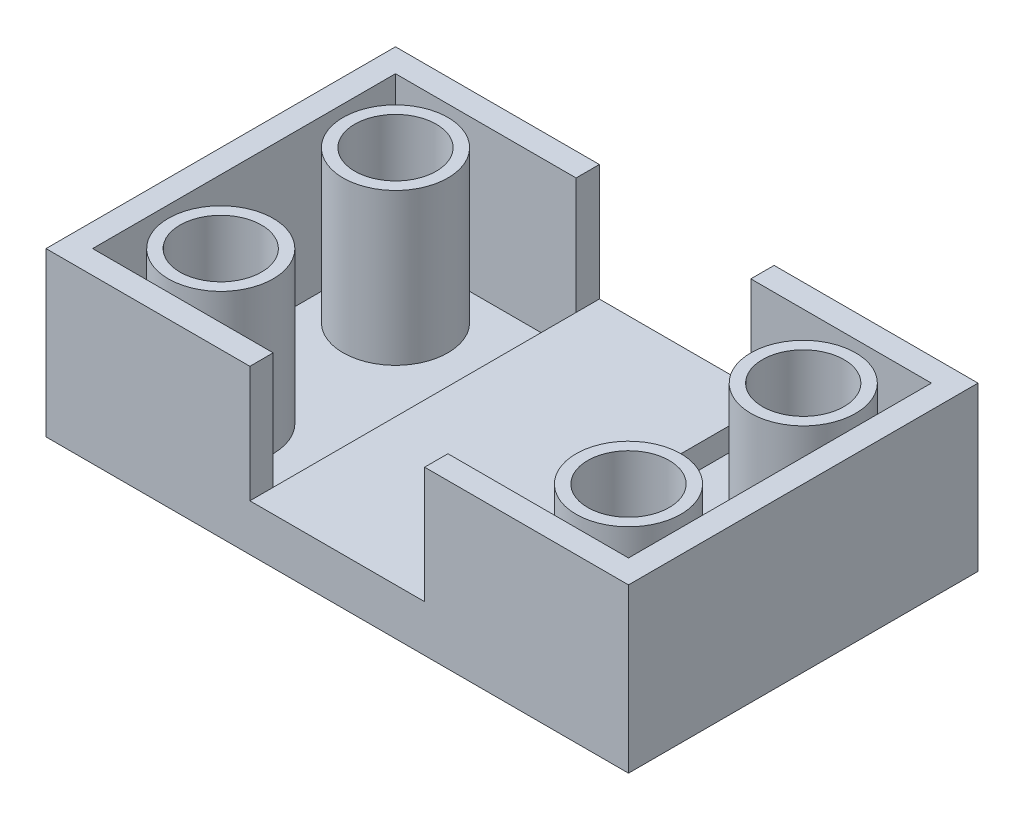
ISO-10303-21;
HEADER;
FILE_DESCRIPTION(('STEP AP214'),'2;1');
FILE_NAME('part.step','',(''),(''),'','','');
FILE_SCHEMA(('AUTOMOTIVE_DESIGN { 1 0 10303 214 1 1 1 1 }'));
ENDSEC;
DATA;
#1=APPLICATION_CONTEXT('core data for automotive mechanical design processes');
#2=APPLICATION_PROTOCOL_DEFINITION('international standard','automotive_design',2000,#1);
#3=PRODUCT_CONTEXT('',#1,'mechanical');
#4=PRODUCT('Part','Part','',(#3));
#5=PRODUCT_RELATED_PRODUCT_CATEGORY('part','',(#4));
#6=PRODUCT_DEFINITION_FORMATION('','',#4);
#7=PRODUCT_DEFINITION_CONTEXT('part definition',#1,'design');
#8=PRODUCT_DEFINITION('design','',#6,#7);
#9=PRODUCT_DEFINITION_SHAPE('','',#8);
#10=(LENGTH_UNIT() NAMED_UNIT(*) SI_UNIT(.MILLI.,.METRE.));
#11=(NAMED_UNIT(*) PLANE_ANGLE_UNIT() SI_UNIT($,.RADIAN.));
#12=(NAMED_UNIT(*) SI_UNIT($,.STERADIAN.) SOLID_ANGLE_UNIT());
#13=UNCERTAINTY_MEASURE_WITH_UNIT(LENGTH_MEASURE(1.E-05),#10,'distance_accuracy_value','');
#14=(GEOMETRIC_REPRESENTATION_CONTEXT(3) GLOBAL_UNCERTAINTY_ASSIGNED_CONTEXT((#13)) GLOBAL_UNIT_ASSIGNED_CONTEXT((#10,
#11,#12)) REPRESENTATION_CONTEXT('',''));
#15=CARTESIAN_POINT('',(0.,0.,0.));
#16=DIRECTION('',(0.,0.,1.));
#17=DIRECTION('',(1.,0.,0.));
#18=AXIS2_PLACEMENT_3D('',#15,#16,#17);
#19=CARTESIAN_POINT('',(17.5,15.,7.50000000000002));
#20=DIRECTION('',(0.,-1.,0.));
#21=DIRECTION('',(0.,0.,-1.));
#22=AXIS2_PLACEMENT_3D('',#19,#20,#21);
#23=CYLINDRICAL_SURFACE('',#22,2.5);
#24=CARTESIAN_POINT('',(17.5,0.750000000000001,7.50000000000002));
#25=DIRECTION('',(0.,1.,0.));
#26=DIRECTION('',(0.,0.,1.));
#27=AXIS2_PLACEMENT_3D('',#24,#25,#26);
#28=CIRCLE('',#27,2.5);
#29=CARTESIAN_POINT('',(17.5,0.750000000000001,10.));
#30=VERTEX_POINT('',#29);
#31=EDGE_CURVE('E399',#30,#30,#28,.F.);
#32=ORIENTED_EDGE('',*,*,#31,.T.);
#33=EDGE_LOOP('',(#32));
#34=FACE_BOUND('',#33,.T.);
#35=CARTESIAN_POINT('',(17.5,10.,7.50000000000002));
#36=DIRECTION('',(0.,1.,0.));
#37=DIRECTION('',(0.,0.,1.));
#38=AXIS2_PLACEMENT_3D('',#35,#36,#37);
#39=CIRCLE('',#38,2.5);
#40=CARTESIAN_POINT('',(17.5,10.,10.));
#41=VERTEX_POINT('',#40);
#42=EDGE_CURVE('E430',#41,#41,#39,.T.);
#43=ORIENTED_EDGE('',*,*,#42,.T.);
#44=EDGE_LOOP('',(#43));
#45=FACE_BOUND('',#44,.T.);
#46=ADVANCED_FACE('F39',(#34,#45),#23,.F.);
#47=CARTESIAN_POINT('',(17.5,15.,-7.49999999999994));
#48=DIRECTION('',(0.,-1.,0.));
#49=DIRECTION('',(0.,0.,-1.));
#50=AXIS2_PLACEMENT_3D('',#47,#48,#49);
#51=CYLINDRICAL_SURFACE('',#50,2.5);
#52=CARTESIAN_POINT('',(17.5,0.750000000000001,-7.49999999999994));
#53=DIRECTION('',(0.,1.,0.));
#54=DIRECTION('',(0.,0.,1.));
#55=AXIS2_PLACEMENT_3D('',#52,#53,#54);
#56=CIRCLE('',#55,2.5);
#57=CARTESIAN_POINT('',(17.5,0.750000000000001,-4.99999999999994));
#58=VERTEX_POINT('',#57);
#59=EDGE_CURVE('E403',#58,#58,#56,.F.);
#60=ORIENTED_EDGE('',*,*,#59,.T.);
#61=EDGE_LOOP('',(#60));
#62=FACE_BOUND('',#61,.T.);
#63=CARTESIAN_POINT('',(17.5,10.,-7.49999999999994));
#64=DIRECTION('',(0.,1.,0.));
#65=DIRECTION('',(0.,0.,1.));
#66=AXIS2_PLACEMENT_3D('',#63,#64,#65);
#67=CIRCLE('',#66,2.5);
#68=CARTESIAN_POINT('',(17.5,10.,-4.99999999999994));
#69=VERTEX_POINT('',#68);
#70=EDGE_CURVE('E424',#69,#69,#67,.T.);
#71=ORIENTED_EDGE('',*,*,#70,.T.);
#72=EDGE_LOOP('',(#71));
#73=FACE_BOUND('',#72,.T.);
#74=ADVANCED_FACE('F532',(#62,#73),#51,.F.);
#75=CARTESIAN_POINT('',(-17.5,15.,-7.4999999999999));
#76=DIRECTION('',(0.,-1.,0.));
#77=DIRECTION('',(0.,0.,-1.));
#78=AXIS2_PLACEMENT_3D('',#75,#76,#77);
#79=CYLINDRICAL_SURFACE('',#78,2.49999999999999);
#80=CARTESIAN_POINT('',(-17.5,0.750000000000001,-7.4999999999999));
#81=DIRECTION('',(0.,1.,0.));
#82=DIRECTION('',(0.,0.,1.));
#83=AXIS2_PLACEMENT_3D('',#80,#81,#82);
#84=CIRCLE('',#83,2.49999999999999);
#85=CARTESIAN_POINT('',(-17.5,0.750000000000001,-4.9999999999999));
#86=VERTEX_POINT('',#85);
#87=EDGE_CURVE('E411',#86,#86,#84,.F.);
#88=ORIENTED_EDGE('',*,*,#87,.T.);
#89=EDGE_LOOP('',(#88));
#90=FACE_BOUND('',#89,.T.);
#91=CARTESIAN_POINT('',(-17.5,10.,-7.4999999999999));
#92=DIRECTION('',(0.,1.,0.));
#93=DIRECTION('',(0.,0.,1.));
#94=AXIS2_PLACEMENT_3D('',#91,#92,#93);
#95=CIRCLE('',#94,2.49999999999999);
#96=CARTESIAN_POINT('',(-17.5,10.,-4.9999999999999));
#97=VERTEX_POINT('',#96);
#98=EDGE_CURVE('E419',#97,#97,#95,.T.);
#99=ORIENTED_EDGE('',*,*,#98,.T.);
#100=EDGE_LOOP('',(#99));
#101=FACE_BOUND('',#100,.T.);
#102=ADVANCED_FACE('F538',(#90,#101),#79,.F.);
#103=CARTESIAN_POINT('',(-17.5,15.,7.49999999999998));
#104=DIRECTION('',(0.,-1.,0.));
#105=DIRECTION('',(0.,0.,-1.));
#106=AXIS2_PLACEMENT_3D('',#103,#104,#105);
#107=CYLINDRICAL_SURFACE('',#106,2.49999999999999);
#108=CARTESIAN_POINT('',(-17.5,0.750000000000001,7.49999999999998));
#109=DIRECTION('',(0.,1.,0.));
#110=DIRECTION('',(0.,0.,1.));
#111=AXIS2_PLACEMENT_3D('',#108,#109,#110);
#112=CIRCLE('',#111,2.49999999999999);
#113=CARTESIAN_POINT('',(-17.5,0.750000000000001,9.99999999999997));
#114=VERTEX_POINT('',#113);
#115=EDGE_CURVE('E407',#114,#114,#112,.F.);
#116=ORIENTED_EDGE('',*,*,#115,.T.);
#117=EDGE_LOOP('',(#116));
#118=FACE_BOUND('',#117,.T.);
#119=CARTESIAN_POINT('',(-17.5,10.,7.49999999999998));
#120=DIRECTION('',(0.,1.,0.));
#121=DIRECTION('',(0.,0.,1.));
#122=AXIS2_PLACEMENT_3D('',#119,#120,#121);
#123=CIRCLE('',#122,2.49999999999999);
#124=CARTESIAN_POINT('',(-17.5,10.,9.99999999999997));
#125=VERTEX_POINT('',#124);
#126=EDGE_CURVE('E260',#125,#125,#123,.T.);
#127=ORIENTED_EDGE('',*,*,#126,.T.);
#128=EDGE_LOOP('',(#127));
#129=FACE_BOUND('',#128,.T.);
#130=ADVANCED_FACE('F509',(#118,#129),#107,.F.);
#131=CARTESIAN_POINT('',(0.,15.,0.));
#132=DIRECTION('',(0.,1.,0.));
#133=DIRECTION('',(0.,0.,1.));
#134=AXIS2_PLACEMENT_3D('',#131,#132,#133);
#135=PLANE('',#134);
#136=CARTESIAN_POINT('',(-17.5,15.,7.49999999999998));
#137=DIRECTION('',(0.,1.,0.));
#138=DIRECTION('',(0.,0.,1.));
#139=AXIS2_PLACEMENT_3D('',#136,#137,#138);
#140=CIRCLE('',#139,3.5);
#141=CARTESIAN_POINT('',(-17.5,15.,11.));
#142=VERTEX_POINT('',#141);
#143=EDGE_CURVE('E220',#142,#142,#140,.T.);
#144=ORIENTED_EDGE('',*,*,#143,.F.);
#145=EDGE_LOOP('',(#144));
#146=FACE_BOUND('',#145,.T.);
#147=CARTESIAN_POINT('',(-17.5,15.,7.49999999999998));
#148=DIRECTION('',(0.,1.,0.));
#149=DIRECTION('',(0.,0.,1.));
#150=AXIS2_PLACEMENT_3D('',#147,#148,#149);
#151=CIRCLE('',#150,4.5);
#152=CARTESIAN_POINT('',(-17.5,15.,12.));
#153=VERTEX_POINT('',#152);
#154=EDGE_CURVE('E264',#153,#153,#151,.T.);
#155=ORIENTED_EDGE('',*,*,#154,.T.);
#156=EDGE_LOOP('',(#155));
#157=FACE_BOUND('',#156,.T.);
#158=ADVANCED_FACE('F505',(#146,#157),#135,.T.);
#159=CARTESIAN_POINT('',(-17.5,15.,-7.4999999999999));
#160=DIRECTION('',(0.,1.,0.));
#161=DIRECTION('',(0.,0.,1.));
#162=AXIS2_PLACEMENT_3D('',#159,#160,#161);
#163=CIRCLE('',#162,3.5);
#164=CARTESIAN_POINT('',(-17.5,15.,-3.9999999999999));
#165=VERTEX_POINT('',#164);
#166=EDGE_CURVE('E428',#165,#165,#163,.T.);
#167=ORIENTED_EDGE('',*,*,#166,.F.);
#168=EDGE_LOOP('',(#167));
#169=FACE_BOUND('',#168,.T.);
#170=CARTESIAN_POINT('',(-17.5,15.,-7.4999999999999));
#171=DIRECTION('',(0.,1.,0.));
#172=DIRECTION('',(0.,0.,1.));
#173=AXIS2_PLACEMENT_3D('',#170,#171,#172);
#174=CIRCLE('',#173,4.5);
#175=CARTESIAN_POINT('',(-17.5,15.,-2.9999999999999));
#176=VERTEX_POINT('',#175);
#177=EDGE_CURVE('E211',#176,#176,#174,.T.);
#178=ORIENTED_EDGE('',*,*,#177,.T.);
#179=EDGE_LOOP('',(#178));
#180=FACE_BOUND('',#179,.T.);
#181=ADVANCED_FACE('F508',(#169,#180),#135,.T.);
#182=CARTESIAN_POINT('',(17.5,15.,7.50000000000002));
#183=DIRECTION('',(0.,1.,0.));
#184=DIRECTION('',(0.,0.,1.));
#185=AXIS2_PLACEMENT_3D('',#182,#183,#184);
#186=CIRCLE('',#185,3.5);
#187=CARTESIAN_POINT('',(17.5,15.,11.));
#188=VERTEX_POINT('',#187);
#189=EDGE_CURVE('E470',#188,#188,#186,.T.);
#190=ORIENTED_EDGE('',*,*,#189,.F.);
#191=EDGE_LOOP('',(#190));
#192=FACE_BOUND('',#191,.T.);
#193=CARTESIAN_POINT('',(17.5,15.,7.50000000000002));
#194=DIRECTION('',(0.,1.,0.));
#195=DIRECTION('',(0.,0.,1.));
#196=AXIS2_PLACEMENT_3D('',#193,#194,#195);
#197=CIRCLE('',#196,4.5);
#198=CARTESIAN_POINT('',(17.5,15.,12.));
#199=VERTEX_POINT('',#198);
#200=EDGE_CURVE('E284',#199,#199,#197,.T.);
#201=ORIENTED_EDGE('',*,*,#200,.T.);
#202=EDGE_LOOP('',(#201));
#203=FACE_BOUND('',#202,.T.);
#204=ADVANCED_FACE('F699',(#192,#203),#135,.T.);
#205=CARTESIAN_POINT('',(17.5,15.,-7.49999999999994));
#206=DIRECTION('',(0.,1.,0.));
#207=DIRECTION('',(0.,0.,1.));
#208=AXIS2_PLACEMENT_3D('',#205,#206,#207);
#209=CIRCLE('',#208,3.5);
#210=CARTESIAN_POINT('',(17.5,15.,-3.99999999999994));
#211=VERTEX_POINT('',#210);
#212=EDGE_CURVE('E434',#211,#211,#209,.T.);
#213=ORIENTED_EDGE('',*,*,#212,.F.);
#214=EDGE_LOOP('',(#213));
#215=FACE_BOUND('',#214,.T.);
#216=CARTESIAN_POINT('',(17.5,15.,-7.49999999999994));
#217=DIRECTION('',(0.,1.,0.));
#218=DIRECTION('',(0.,0.,1.));
#219=AXIS2_PLACEMENT_3D('',#216,#217,#218);
#220=CIRCLE('',#219,4.5);
#221=CARTESIAN_POINT('',(17.5,15.,-2.99999999999994));
#222=VERTEX_POINT('',#221);
#223=EDGE_CURVE('E217',#222,#222,#220,.T.);
#224=ORIENTED_EDGE('',*,*,#223,.T.);
#225=EDGE_LOOP('',(#224));
#226=FACE_BOUND('',#225,.T.);
#227=ADVANCED_FACE('F694',(#215,#226),#135,.T.);
#228=CARTESIAN_POINT('',(-7.5,5.,15.));
#229=DIRECTION('',(-1.,0.,0.));
#230=DIRECTION('',(0.,0.,1.));
#231=AXIS2_PLACEMENT_3D('',#228,#229,#230);
#232=PLANE('',#231);
#233=DIRECTION('',(0.,1.,0.));
#234=VECTOR('',#233,1.);
#235=CARTESIAN_POINT('',(-7.5,5.,-12.9999999999999));
#236=LINE('',#235,#234);
#237=CARTESIAN_POINT('',(-7.5,5.,-12.9999999999999));
#238=VERTEX_POINT('',#237);
#239=CARTESIAN_POINT('',(-7.5,15.,-12.9999999999999));
#240=VERTEX_POINT('',#239);
#241=EDGE_CURVE('E266',#238,#240,#236,.T.);
#242=ORIENTED_EDGE('',*,*,#241,.F.);
#243=DIRECTION('',(0.,0.,1.));
#244=VECTOR('',#243,1.);
#245=CARTESIAN_POINT('',(-7.5,5.,15.));
#246=LINE('',#245,#244);
#247=CARTESIAN_POINT('',(-7.5,5.,-15.));
#248=VERTEX_POINT('',#247);
#249=EDGE_CURVE('E310',#248,#238,#246,.T.);
#250=ORIENTED_EDGE('',*,*,#249,.F.);
#251=DIRECTION('',(0.,1.,0.));
#252=VECTOR('',#251,1.);
#253=CARTESIAN_POINT('',(-7.5,5.,-15.));
#254=LINE('',#253,#252);
#255=CARTESIAN_POINT('',(-7.5,15.,-15.));
#256=VERTEX_POINT('',#255);
#257=EDGE_CURVE('E340',#248,#256,#254,.T.);
#258=ORIENTED_EDGE('',*,*,#257,.T.);
#259=DIRECTION('',(0.,0.,1.));
#260=VECTOR('',#259,1.);
#261=CARTESIAN_POINT('',(-7.5,15.,15.));
#262=LINE('',#261,#260);
#263=EDGE_CURVE('E331',#256,#240,#262,.T.);
#264=ORIENTED_EDGE('',*,*,#263,.T.);
#265=EDGE_LOOP('',(#242,#250,#258,#264));
#266=FACE_BOUND('',#265,.T.);
#267=ADVANCED_FACE('F653',(#266),#232,.F.);
#268=CARTESIAN_POINT('',(7.5,5.,15.));
#269=DIRECTION('',(1.,0.,0.));
#270=DIRECTION('',(0.,0.,-1.));
#271=AXIS2_PLACEMENT_3D('',#268,#269,#270);
#272=PLANE('',#271);
#273=DIRECTION('',(0.,1.,0.));
#274=VECTOR('',#273,1.);
#275=CARTESIAN_POINT('',(7.5,5.,13.));
#276=LINE('',#275,#274);
#277=CARTESIAN_POINT('',(7.5,5.,13.));
#278=VERTEX_POINT('',#277);
#279=CARTESIAN_POINT('',(7.5,15.,13.));
#280=VERTEX_POINT('',#279);
#281=EDGE_CURVE('E283',#278,#280,#276,.T.);
#282=ORIENTED_EDGE('',*,*,#281,.F.);
#283=DIRECTION('',(0.,0.,-1.));
#284=VECTOR('',#283,1.);
#285=CARTESIAN_POINT('',(7.5,5.,15.));
#286=LINE('',#285,#284);
#287=CARTESIAN_POINT('',(7.5,5.,15.));
#288=VERTEX_POINT('',#287);
#289=EDGE_CURVE('E321',#288,#278,#286,.T.);
#290=ORIENTED_EDGE('',*,*,#289,.F.);
#291=DIRECTION('',(0.,1.,0.));
#292=VECTOR('',#291,1.);
#293=CARTESIAN_POINT('',(7.5,5.,15.));
#294=LINE('',#293,#292);
#295=CARTESIAN_POINT('',(7.5,15.,15.));
#296=VERTEX_POINT('',#295);
#297=EDGE_CURVE('E348',#288,#296,#294,.T.);
#298=ORIENTED_EDGE('',*,*,#297,.T.);
#299=DIRECTION('',(0.,0.,-1.));
#300=VECTOR('',#299,1.);
#301=CARTESIAN_POINT('',(7.5,15.,15.));
#302=LINE('',#301,#300);
#303=EDGE_CURVE('E336',#296,#280,#302,.T.);
#304=ORIENTED_EDGE('',*,*,#303,.T.);
#305=EDGE_LOOP('',(#282,#290,#298,#304));
#306=FACE_BOUND('',#305,.T.);
#307=ADVANCED_FACE('F669',(#306),#272,.F.);
#308=DIRECTION('',(-1.,0.,0.));
#309=VECTOR('',#308,1.);
#310=CARTESIAN_POINT('',(25.,15.,-13.));
#311=LINE('',#310,#309);
#312=CARTESIAN_POINT('',(-23.,15.,-12.9999999999999));
#313=VERTEX_POINT('',#312);
#314=EDGE_CURVE('E198',#240,#313,#311,.T.);
#315=ORIENTED_EDGE('',*,*,#314,.F.);
#316=ORIENTED_EDGE('',*,*,#263,.F.);
#317=DIRECTION('',(-1.,0.,0.));
#318=VECTOR('',#317,1.);
#319=CARTESIAN_POINT('',(25.,15.,-15.));
#320=LINE('',#319,#318);
#321=CARTESIAN_POINT('',(-25.,15.,-14.9999999999999));
#322=VERTEX_POINT('',#321);
#323=EDGE_CURVE('E365',#256,#322,#320,.T.);
#324=ORIENTED_EDGE('',*,*,#323,.T.);
#325=DIRECTION('',(0.,0.,1.));
#326=VECTOR('',#325,1.);
#327=CARTESIAN_POINT('',(-25.,15.,15.));
#328=LINE('',#327,#326);
#329=CARTESIAN_POINT('',(-25.,15.,15.));
#330=VERTEX_POINT('',#329);
#331=EDGE_CURVE('E343',#322,#330,#328,.T.);
#332=ORIENTED_EDGE('',*,*,#331,.T.);
#333=DIRECTION('',(1.,0.,0.));
#334=VECTOR('',#333,1.);
#335=CARTESIAN_POINT('',(25.,15.,15.));
#336=LINE('',#335,#334);
#337=CARTESIAN_POINT('',(-7.5,15.,15.));
#338=VERTEX_POINT('',#337);
#339=EDGE_CURVE('E358',#330,#338,#336,.T.);
#340=ORIENTED_EDGE('',*,*,#339,.T.);
#341=CARTESIAN_POINT('',(-7.5,15.,13.));
#342=VERTEX_POINT('',#341);
#343=EDGE_CURVE('E309',#342,#338,#262,.T.);
#344=ORIENTED_EDGE('',*,*,#343,.F.);
#345=DIRECTION('',(1.,0.,0.));
#346=VECTOR('',#345,1.);
#347=CARTESIAN_POINT('',(25.,15.,13.));
#348=LINE('',#347,#346);
#349=CARTESIAN_POINT('',(-23.,15.,13.));
#350=VERTEX_POINT('',#349);
#351=EDGE_CURVE('E248',#350,#342,#348,.T.);
#352=ORIENTED_EDGE('',*,*,#351,.F.);
#353=DIRECTION('',(0.,0.,1.));
#354=VECTOR('',#353,1.);
#355=CARTESIAN_POINT('',(-23.,15.,15.));
#356=LINE('',#355,#354);
#357=EDGE_CURVE('E192',#313,#350,#356,.T.);
#358=ORIENTED_EDGE('',*,*,#357,.F.);
#359=EDGE_LOOP('',(#315,#316,#324,#332,#340,#344,#352,#358));
#360=FACE_BOUND('',#359,.T.);
#361=ADVANCED_FACE('F550',(#360),#135,.T.);
#362=DIRECTION('',(1.,0.,0.));
#363=VECTOR('',#362,1.);
#364=CARTESIAN_POINT('',(25.,15.,13.));
#365=LINE('',#364,#363);
#366=CARTESIAN_POINT('',(23.,15.,13.));
#367=VERTEX_POINT('',#366);
#368=EDGE_CURVE('E247',#280,#367,#365,.T.);
#369=ORIENTED_EDGE('',*,*,#368,.F.);
#370=ORIENTED_EDGE('',*,*,#303,.F.);
#371=CARTESIAN_POINT('',(25.,15.,15.));
#372=VERTEX_POINT('',#371);
#373=EDGE_CURVE('E357',#296,#372,#336,.T.);
#374=ORIENTED_EDGE('',*,*,#373,.T.);
#375=DIRECTION('',(0.,0.,-1.));
#376=VECTOR('',#375,1.);
#377=CARTESIAN_POINT('',(25.,15.,15.));
#378=LINE('',#377,#376);
#379=CARTESIAN_POINT('',(25.,15.,-15.));
#380=VERTEX_POINT('',#379);
#381=EDGE_CURVE('E362',#372,#380,#378,.T.);
#382=ORIENTED_EDGE('',*,*,#381,.T.);
#383=CARTESIAN_POINT('',(7.5,15.,-15.));
#384=VERTEX_POINT('',#383);
#385=EDGE_CURVE('E366',#380,#384,#320,.T.);
#386=ORIENTED_EDGE('',*,*,#385,.T.);
#387=CARTESIAN_POINT('',(7.5,15.,-12.9999999999999));
#388=VERTEX_POINT('',#387);
#389=EDGE_CURVE('E335',#388,#384,#302,.T.);
#390=ORIENTED_EDGE('',*,*,#389,.F.);
#391=DIRECTION('',(-1.,0.,0.));
#392=VECTOR('',#391,1.);
#393=CARTESIAN_POINT('',(25.,15.,-13.));
#394=LINE('',#393,#392);
#395=CARTESIAN_POINT('',(23.,15.,-13.));
#396=VERTEX_POINT('',#395);
#397=EDGE_CURVE('E203',#396,#388,#394,.T.);
#398=ORIENTED_EDGE('',*,*,#397,.F.);
#399=DIRECTION('',(0.,0.,-1.));
#400=VECTOR('',#399,1.);
#401=CARTESIAN_POINT('',(23.,15.,15.));
#402=LINE('',#401,#400);
#403=EDGE_CURVE('E251',#367,#396,#402,.T.);
#404=ORIENTED_EDGE('',*,*,#403,.F.);
#405=EDGE_LOOP('',(#369,#370,#374,#382,#386,#390,#398,#404));
#406=FACE_BOUND('',#405,.T.);
#407=ADVANCED_FACE('F511',(#406),#135,.T.);
#408=CARTESIAN_POINT('',(0.,0.,0.));
#409=DIRECTION('',(0.,1.,0.));
#410=DIRECTION('',(0.,0.,1.));
#411=AXIS2_PLACEMENT_3D('',#408,#409,#410);
#412=PLANE('',#411);
#413=DIRECTION('',(1.,0.,0.));
#414=VECTOR('',#413,1.);
#415=CARTESIAN_POINT('',(0.,0.,-13.9999999999999));
#416=LINE('',#415,#414);
#417=CARTESIAN_POINT('',(-24.,0.,-13.9999999999999));
#418=VERTEX_POINT('',#417);
#419=CARTESIAN_POINT('',(24.,0.,-14.));
#420=VERTEX_POINT('',#419);
#421=EDGE_CURVE('E446',#418,#420,#416,.T.);
#422=ORIENTED_EDGE('',*,*,#421,.T.);
#423=DIRECTION('',(0.,0.,1.));
#424=VECTOR('',#423,1.);
#425=CARTESIAN_POINT('',(24.,0.,0.));
#426=LINE('',#425,#424);
#427=CARTESIAN_POINT('',(24.,0.,14.));
#428=VERTEX_POINT('',#427);
#429=EDGE_CURVE('E449',#420,#428,#426,.T.);
#430=ORIENTED_EDGE('',*,*,#429,.T.);
#431=DIRECTION('',(-1.,0.,0.));
#432=VECTOR('',#431,1.);
#433=CARTESIAN_POINT('',(0.,0.,14.));
#434=LINE('',#433,#432);
#435=CARTESIAN_POINT('',(-24.,0.,14.));
#436=VERTEX_POINT('',#435);
#437=EDGE_CURVE('E440',#428,#436,#434,.T.);
#438=ORIENTED_EDGE('',*,*,#437,.T.);
#439=DIRECTION('',(0.,0.,-1.));
#440=VECTOR('',#439,1.);
#441=CARTESIAN_POINT('',(-24.,0.,0.));
#442=LINE('',#441,#440);
#443=EDGE_CURVE('E443',#436,#418,#442,.T.);
#444=ORIENTED_EDGE('',*,*,#443,.T.);
#445=EDGE_LOOP('',(#422,#430,#438,#444));
#446=FACE_BOUND('',#445,.T.);
#447=CARTESIAN_POINT('',(17.5,0.,7.50000000000002));
#448=DIRECTION('',(0.,1.,0.));
#449=DIRECTION('',(0.,0.,1.));
#450=AXIS2_PLACEMENT_3D('',#447,#448,#449);
#451=CIRCLE('',#450,3.79903810567665);
#452=CARTESIAN_POINT('',(17.5,0.,11.2990381056767));
#453=VERTEX_POINT('',#452);
#454=EDGE_CURVE('E395',#453,#453,#451,.T.);
#455=ORIENTED_EDGE('',*,*,#454,.T.);
#456=EDGE_LOOP('',(#455));
#457=FACE_BOUND('',#456,.T.);
#458=CARTESIAN_POINT('',(17.5,0.,-7.49999999999994));
#459=DIRECTION('',(0.,1.,0.));
#460=DIRECTION('',(0.,0.,1.));
#461=AXIS2_PLACEMENT_3D('',#458,#459,#460);
#462=CIRCLE('',#461,3.79903810567665);
#463=CARTESIAN_POINT('',(17.5,0.,-3.70096189432328));
#464=VERTEX_POINT('',#463);
#465=EDGE_CURVE('E391',#464,#464,#462,.T.);
#466=ORIENTED_EDGE('',*,*,#465,.T.);
#467=EDGE_LOOP('',(#466));
#468=FACE_BOUND('',#467,.T.);
#469=CARTESIAN_POINT('',(-17.5,0.,7.49999999999998));
#470=DIRECTION('',(0.,1.,0.));
#471=DIRECTION('',(0.,0.,1.));
#472=AXIS2_PLACEMENT_3D('',#469,#470,#471);
#473=CIRCLE('',#472,3.79903810567665);
#474=CARTESIAN_POINT('',(-17.5,0.,11.2990381056766));
#475=VERTEX_POINT('',#474);
#476=EDGE_CURVE('E387',#475,#475,#473,.T.);
#477=ORIENTED_EDGE('',*,*,#476,.T.);
#478=EDGE_LOOP('',(#477));
#479=FACE_BOUND('',#478,.T.);
#480=CARTESIAN_POINT('',(-17.5,0.,-7.4999999999999));
#481=DIRECTION('',(0.,1.,0.));
#482=DIRECTION('',(0.,0.,1.));
#483=AXIS2_PLACEMENT_3D('',#480,#481,#482);
#484=CIRCLE('',#483,3.79903810567665);
#485=CARTESIAN_POINT('',(-17.5,0.,-3.70096189432325));
#486=VERTEX_POINT('',#485);
#487=EDGE_CURVE('E383',#486,#486,#484,.T.);
#488=ORIENTED_EDGE('',*,*,#487,.T.);
#489=EDGE_LOOP('',(#488));
#490=FACE_BOUND('',#489,.T.);
#491=ADVANCED_FACE('F549',(#446,#457,#468,#479,#490),#412,.F.);
#492=CARTESIAN_POINT('',(-25.,15.,15.));
#493=DIRECTION('',(1.,0.,0.));
#494=DIRECTION('',(0.,0.,-1.));
#495=AXIS2_PLACEMENT_3D('',#492,#493,#494);
#496=PLANE('',#495);
#497=DIRECTION('',(0.,-1.,0.));
#498=VECTOR('',#497,1.);
#499=CARTESIAN_POINT('',(-25.,15.,-14.9999999999999));
#500=LINE('',#499,#498);
#501=CARTESIAN_POINT('',(-25.,1.,-14.9999999999999));
#502=VERTEX_POINT('',#501);
#503=EDGE_CURVE('E370',#322,#502,#500,.T.);
#504=ORIENTED_EDGE('',*,*,#503,.T.);
#505=DIRECTION('',(0.,0.,1.));
#506=VECTOR('',#505,1.);
#507=CARTESIAN_POINT('',(-25.,1.,15.));
#508=LINE('',#507,#506);
#509=CARTESIAN_POINT('',(-25.,1.,15.));
#510=VERTEX_POINT('',#509);
#511=EDGE_CURVE('E49',#502,#510,#508,.T.);
#512=ORIENTED_EDGE('',*,*,#511,.T.);
#513=DIRECTION('',(0.,-1.,0.));
#514=VECTOR('',#513,1.);
#515=CARTESIAN_POINT('',(-25.,15.,15.));
#516=LINE('',#515,#514);
#517=EDGE_CURVE('E380',#330,#510,#516,.T.);
#518=ORIENTED_EDGE('',*,*,#517,.F.);
#519=ORIENTED_EDGE('',*,*,#331,.F.);
#520=EDGE_LOOP('',(#504,#512,#518,#519));
#521=FACE_BOUND('',#520,.T.);
#522=ADVANCED_FACE('F554',(#521),#496,.F.);
#523=CARTESIAN_POINT('',(25.,15.,15.));
#524=DIRECTION('',(0.,0.,-1.));
#525=DIRECTION('',(-1.,0.,0.));
#526=AXIS2_PLACEMENT_3D('',#523,#524,#525);
#527=PLANE('',#526);
#528=ORIENTED_EDGE('',*,*,#517,.T.);
#529=DIRECTION('',(1.,0.,0.));
#530=VECTOR('',#529,1.);
#531=CARTESIAN_POINT('',(25.,1.,15.));
#532=LINE('',#531,#530);
#533=CARTESIAN_POINT('',(25.,1.,15.));
#534=VERTEX_POINT('',#533);
#535=EDGE_CURVE('E11',#510,#534,#532,.T.);
#536=ORIENTED_EDGE('',*,*,#535,.T.);
#537=DIRECTION('',(0.,-1.,0.));
#538=VECTOR('',#537,1.);
#539=CARTESIAN_POINT('',(25.,15.,15.));
#540=LINE('',#539,#538);
#541=EDGE_CURVE('E376',#372,#534,#540,.T.);
#542=ORIENTED_EDGE('',*,*,#541,.F.);
#543=ORIENTED_EDGE('',*,*,#373,.F.);
#544=ORIENTED_EDGE('',*,*,#297,.F.);
#545=DIRECTION('',(1.,0.,0.));
#546=VECTOR('',#545,1.);
#547=CARTESIAN_POINT('',(7.5,5.,15.));
#548=LINE('',#547,#546);
#549=CARTESIAN_POINT('',(-7.5,5.,15.));
#550=VERTEX_POINT('',#549);
#551=EDGE_CURVE('E314',#550,#288,#548,.T.);
#552=ORIENTED_EDGE('',*,*,#551,.F.);
#553=DIRECTION('',(0.,1.,0.));
#554=VECTOR('',#553,1.);
#555=CARTESIAN_POINT('',(-7.5,5.,15.));
#556=LINE('',#555,#554);
#557=EDGE_CURVE('E330',#550,#338,#556,.T.);
#558=ORIENTED_EDGE('',*,*,#557,.T.);
#559=ORIENTED_EDGE('',*,*,#339,.F.);
#560=EDGE_LOOP('',(#528,#536,#542,#543,#544,#552,#558,#559));
#561=FACE_BOUND('',#560,.T.);
#562=ADVANCED_FACE('F563',(#561),#527,.F.);
#563=CARTESIAN_POINT('',(25.,15.,15.));
#564=DIRECTION('',(-1.,0.,0.));
#565=DIRECTION('',(0.,0.,1.));
#566=AXIS2_PLACEMENT_3D('',#563,#564,#565);
#567=PLANE('',#566);
#568=ORIENTED_EDGE('',*,*,#541,.T.);
#569=DIRECTION('',(0.,0.,-1.));
#570=VECTOR('',#569,1.);
#571=CARTESIAN_POINT('',(25.,1.,15.));
#572=LINE('',#571,#570);
#573=CARTESIAN_POINT('',(25.,1.,-15.));
#574=VERTEX_POINT('',#573);
#575=EDGE_CURVE('E436',#534,#574,#572,.T.);
#576=ORIENTED_EDGE('',*,*,#575,.T.);
#577=DIRECTION('',(0.,-1.,0.));
#578=VECTOR('',#577,1.);
#579=CARTESIAN_POINT('',(25.,15.,-15.));
#580=LINE('',#579,#578);
#581=EDGE_CURVE('E373',#380,#574,#580,.T.);
#582=ORIENTED_EDGE('',*,*,#581,.F.);
#583=ORIENTED_EDGE('',*,*,#381,.F.);
#584=EDGE_LOOP('',(#568,#576,#582,#583));
#585=FACE_BOUND('',#584,.T.);
#586=ADVANCED_FACE('F560',(#585),#567,.F.);
#587=CARTESIAN_POINT('',(25.,15.,-15.));
#588=DIRECTION('',(0.,0.,1.));
#589=DIRECTION('',(1.,0.,0.));
#590=AXIS2_PLACEMENT_3D('',#587,#588,#589);
#591=PLANE('',#590);
#592=ORIENTED_EDGE('',*,*,#581,.T.);
#593=DIRECTION('',(-1.,0.,0.));
#594=VECTOR('',#593,1.);
#595=CARTESIAN_POINT('',(25.,1.,-15.));
#596=LINE('',#595,#594);
#597=EDGE_CURVE('E64',#574,#502,#596,.T.);
#598=ORIENTED_EDGE('',*,*,#597,.T.);
#599=ORIENTED_EDGE('',*,*,#503,.F.);
#600=ORIENTED_EDGE('',*,*,#323,.F.);
#601=ORIENTED_EDGE('',*,*,#257,.F.);
#602=DIRECTION('',(-1.,0.,0.));
#603=VECTOR('',#602,1.);
#604=CARTESIAN_POINT('',(7.5,5.,-15.));
#605=LINE('',#604,#603);
#606=CARTESIAN_POINT('',(7.5,5.,-14.9999999999999));
#607=VERTEX_POINT('',#606);
#608=EDGE_CURVE('E325',#607,#248,#605,.T.);
#609=ORIENTED_EDGE('',*,*,#608,.F.);
#610=DIRECTION('',(0.,1.,0.));
#611=VECTOR('',#610,1.);
#612=CARTESIAN_POINT('',(7.5,5.,-15.));
#613=LINE('',#612,#611);
#614=EDGE_CURVE('E344',#607,#384,#613,.T.);
#615=ORIENTED_EDGE('',*,*,#614,.T.);
#616=ORIENTED_EDGE('',*,*,#385,.F.);
#617=EDGE_LOOP('',(#592,#598,#599,#600,#601,#609,#615,#616));
#618=FACE_BOUND('',#617,.T.);
#619=ADVANCED_FACE('F556',(#618),#591,.F.);
#620=CARTESIAN_POINT('',(-7.5,5.,13.));
#621=VERTEX_POINT('',#620);
#622=EDGE_CURVE('E316',#621,#550,#246,.T.);
#623=ORIENTED_EDGE('',*,*,#622,.F.);
#624=DIRECTION('',(0.,1.,0.));
#625=VECTOR('',#624,1.);
#626=CARTESIAN_POINT('',(-7.5,15.,13.));
#627=LINE('',#626,#625);
#628=EDGE_CURVE('E256',#621,#342,#627,.T.);
#629=ORIENTED_EDGE('',*,*,#628,.T.);
#630=ORIENTED_EDGE('',*,*,#343,.T.);
#631=ORIENTED_EDGE('',*,*,#557,.F.);
#632=EDGE_LOOP('',(#623,#629,#630,#631));
#633=FACE_BOUND('',#632,.T.);
#634=ADVANCED_FACE('F559',(#633),#232,.F.);
#635=CARTESIAN_POINT('',(7.5,5.,-12.9999999999999));
#636=VERTEX_POINT('',#635);
#637=EDGE_CURVE('E320',#636,#607,#286,.T.);
#638=ORIENTED_EDGE('',*,*,#637,.F.);
#639=DIRECTION('',(0.,1.,0.));
#640=VECTOR('',#639,1.);
#641=CARTESIAN_POINT('',(7.5,15.,-12.9999999999999));
#642=LINE('',#641,#640);
#643=EDGE_CURVE('E278',#636,#388,#642,.T.);
#644=ORIENTED_EDGE('',*,*,#643,.T.);
#645=ORIENTED_EDGE('',*,*,#389,.T.);
#646=ORIENTED_EDGE('',*,*,#614,.F.);
#647=EDGE_LOOP('',(#638,#644,#645,#646));
#648=FACE_BOUND('',#647,.T.);
#649=ADVANCED_FACE('F658',(#648),#272,.F.);
#650=CARTESIAN_POINT('',(0.,5.,0.));
#651=DIRECTION('',(0.,1.,0.));
#652=DIRECTION('',(0.,0.,1.));
#653=AXIS2_PLACEMENT_3D('',#650,#651,#652);
#654=PLANE('',#653);
#655=ORIENTED_EDGE('',*,*,#249,.T.);
#656=EDGE_CURVE('E315',#238,#621,#246,.T.);
#657=ORIENTED_EDGE('',*,*,#656,.T.);
#658=ORIENTED_EDGE('',*,*,#622,.T.);
#659=ORIENTED_EDGE('',*,*,#551,.T.);
#660=ORIENTED_EDGE('',*,*,#289,.T.);
#661=EDGE_CURVE('E326',#278,#636,#286,.T.);
#662=ORIENTED_EDGE('',*,*,#661,.T.);
#663=ORIENTED_EDGE('',*,*,#637,.T.);
#664=ORIENTED_EDGE('',*,*,#608,.T.);
#665=EDGE_LOOP('',(#655,#657,#658,#659,#660,#662,#663,#664));
#666=FACE_BOUND('',#665,.T.);
#667=ADVANCED_FACE('F574',(#666),#654,.T.);
#668=CARTESIAN_POINT('',(17.5,0.,7.50000000000002));
#669=DIRECTION('',(0.,-1.,0.));
#670=DIRECTION('',(0.,0.,-1.));
#671=AXIS2_PLACEMENT_3D('',#668,#669,#670);
#672=CONICAL_SURFACE('',#671,3.79903810567665,1.0471975511966);
#673=ORIENTED_EDGE('',*,*,#31,.F.);
#674=EDGE_LOOP('',(#673));
#675=FACE_BOUND('',#674,.T.);
#676=ORIENTED_EDGE('',*,*,#454,.F.);
#677=EDGE_LOOP('',(#676));
#678=FACE_BOUND('',#677,.T.);
#679=ADVANCED_FACE('F570',(#675,#678),#672,.F.);
#680=CARTESIAN_POINT('',(17.5,0.,-7.49999999999994));
#681=DIRECTION('',(0.,-1.,0.));
#682=DIRECTION('',(0.,0.,-1.));
#683=AXIS2_PLACEMENT_3D('',#680,#681,#682);
#684=CONICAL_SURFACE('',#683,3.79903810567665,1.0471975511966);
#685=ORIENTED_EDGE('',*,*,#59,.F.);
#686=EDGE_LOOP('',(#685));
#687=FACE_BOUND('',#686,.T.);
#688=ORIENTED_EDGE('',*,*,#465,.F.);
#689=EDGE_LOOP('',(#688));
#690=FACE_BOUND('',#689,.T.);
#691=ADVANCED_FACE('F573',(#687,#690),#684,.F.);
#692=CARTESIAN_POINT('',(-17.5,0.,7.49999999999998));
#693=DIRECTION('',(0.,-1.,0.));
#694=DIRECTION('',(0.,0.,-1.));
#695=AXIS2_PLACEMENT_3D('',#692,#693,#694);
#696=CONICAL_SURFACE('',#695,3.79903810567665,1.04719755119659);
#697=ORIENTED_EDGE('',*,*,#115,.F.);
#698=EDGE_LOOP('',(#697));
#699=FACE_BOUND('',#698,.T.);
#700=ORIENTED_EDGE('',*,*,#476,.F.);
#701=EDGE_LOOP('',(#700));
#702=FACE_BOUND('',#701,.T.);
#703=ADVANCED_FACE('F578',(#699,#702),#696,.F.);
#704=CARTESIAN_POINT('',(-17.5,0.,-7.4999999999999));
#705=DIRECTION('',(0.,-1.,0.));
#706=DIRECTION('',(0.,0.,-1.));
#707=AXIS2_PLACEMENT_3D('',#704,#705,#706);
#708=CONICAL_SURFACE('',#707,3.79903810567665,1.04719755119659);
#709=ORIENTED_EDGE('',*,*,#87,.F.);
#710=EDGE_LOOP('',(#709));
#711=FACE_BOUND('',#710,.T.);
#712=ORIENTED_EDGE('',*,*,#487,.F.);
#713=EDGE_LOOP('',(#712));
#714=FACE_BOUND('',#713,.T.);
#715=ADVANCED_FACE('F582',(#711,#714),#708,.F.);
#716=CARTESIAN_POINT('',(0.,2.,0.));
#717=DIRECTION('',(0.,1.,0.));
#718=DIRECTION('',(0.,0.,1.));
#719=AXIS2_PLACEMENT_3D('',#716,#717,#718);
#720=PLANE('',#719);
#721=CARTESIAN_POINT('',(-17.5,2.,7.49999999999998));
#722=DIRECTION('',(0.,1.,0.));
#723=DIRECTION('',(0.,0.,1.));
#724=AXIS2_PLACEMENT_3D('',#721,#722,#723);
#725=CIRCLE('',#724,4.5);
#726=CARTESIAN_POINT('',(-17.5,2.,12.));
#727=VERTEX_POINT('',#726);
#728=EDGE_CURVE('E301',#727,#727,#725,.T.);
#729=ORIENTED_EDGE('',*,*,#728,.F.);
#730=EDGE_LOOP('',(#729));
#731=FACE_BOUND('',#730,.T.);
#732=CARTESIAN_POINT('',(17.5,2.,7.50000000000002));
#733=DIRECTION('',(0.,1.,0.));
#734=DIRECTION('',(0.,0.,1.));
#735=AXIS2_PLACEMENT_3D('',#732,#733,#734);
#736=CIRCLE('',#735,4.5);
#737=CARTESIAN_POINT('',(17.5,2.,12.));
#738=VERTEX_POINT('',#737);
#739=EDGE_CURVE('E226',#738,#738,#736,.T.);
#740=ORIENTED_EDGE('',*,*,#739,.F.);
#741=EDGE_LOOP('',(#740));
#742=FACE_BOUND('',#741,.T.);
#743=DIRECTION('',(0.,0.,1.));
#744=VECTOR('',#743,1.);
#745=CARTESIAN_POINT('',(-23.,2.,15.));
#746=LINE('',#745,#744);
#747=CARTESIAN_POINT('',(-23.,2.,-12.9999999999999));
#748=VERTEX_POINT('',#747);
#749=CARTESIAN_POINT('',(-23.,2.,13.));
#750=VERTEX_POINT('',#749);
#751=EDGE_CURVE('E185',#748,#750,#746,.T.);
#752=ORIENTED_EDGE('',*,*,#751,.T.);
#753=DIRECTION('',(1.,0.,0.));
#754=VECTOR('',#753,1.);
#755=CARTESIAN_POINT('',(25.,2.,13.));
#756=LINE('',#755,#754);
#757=CARTESIAN_POINT('',(23.,2.,13.));
#758=VERTEX_POINT('',#757);
#759=EDGE_CURVE('E210',#750,#758,#756,.T.);
#760=ORIENTED_EDGE('',*,*,#759,.T.);
#761=DIRECTION('',(0.,0.,-1.));
#762=VECTOR('',#761,1.);
#763=CARTESIAN_POINT('',(23.,2.,15.));
#764=LINE('',#763,#762);
#765=CARTESIAN_POINT('',(23.,2.,-13.));
#766=VERTEX_POINT('',#765);
#767=EDGE_CURVE('E187',#758,#766,#764,.T.);
#768=ORIENTED_EDGE('',*,*,#767,.T.);
#769=DIRECTION('',(-1.,0.,0.));
#770=VECTOR('',#769,1.);
#771=CARTESIAN_POINT('',(25.,2.,-13.));
#772=LINE('',#771,#770);
#773=EDGE_CURVE('E180',#766,#748,#772,.T.);
#774=ORIENTED_EDGE('',*,*,#773,.T.);
#775=EDGE_LOOP('',(#752,#760,#768,#774));
#776=FACE_BOUND('',#775,.T.);
#777=CARTESIAN_POINT('',(17.5,2.,-7.49999999999994));
#778=DIRECTION('',(0.,1.,0.));
#779=DIRECTION('',(0.,0.,1.));
#780=AXIS2_PLACEMENT_3D('',#777,#778,#779);
#781=CIRCLE('',#780,4.5);
#782=CARTESIAN_POINT('',(17.5,2.,-2.99999999999994));
#783=VERTEX_POINT('',#782);
#784=EDGE_CURVE('E297',#783,#783,#781,.T.);
#785=ORIENTED_EDGE('',*,*,#784,.F.);
#786=EDGE_LOOP('',(#785));
#787=FACE_BOUND('',#786,.T.);
#788=CARTESIAN_POINT('',(-17.5,2.,-7.4999999999999));
#789=DIRECTION('',(0.,1.,0.));
#790=DIRECTION('',(0.,0.,1.));
#791=AXIS2_PLACEMENT_3D('',#788,#789,#790);
#792=CIRCLE('',#791,4.5);
#793=CARTESIAN_POINT('',(-17.5,2.,-2.9999999999999));
#794=VERTEX_POINT('',#793);
#795=EDGE_CURVE('E305',#794,#794,#792,.T.);
#796=ORIENTED_EDGE('',*,*,#795,.F.);
#797=EDGE_LOOP('',(#796));
#798=FACE_BOUND('',#797,.T.);
#799=ADVANCED_FACE('F182',(#731,#742,#776,#787,#798),#720,.T.);
#800=CARTESIAN_POINT('',(-23.,15.,15.));
#801=DIRECTION('',(1.,0.,0.));
#802=DIRECTION('',(0.,0.,-1.));
#803=AXIS2_PLACEMENT_3D('',#800,#801,#802);
#804=PLANE('',#803);
#805=ORIENTED_EDGE('',*,*,#751,.F.);
#806=DIRECTION('',(0.,-1.,0.));
#807=VECTOR('',#806,1.);
#808=CARTESIAN_POINT('',(-23.,15.,-12.9999999999999));
#809=LINE('',#808,#807);
#810=EDGE_CURVE('E195',#313,#748,#809,.T.);
#811=ORIENTED_EDGE('',*,*,#810,.F.);
#812=ORIENTED_EDGE('',*,*,#357,.T.);
#813=DIRECTION('',(0.,-1.,0.));
#814=VECTOR('',#813,1.);
#815=CARTESIAN_POINT('',(-23.,15.,13.));
#816=LINE('',#815,#814);
#817=EDGE_CURVE('E208',#350,#750,#816,.T.);
#818=ORIENTED_EDGE('',*,*,#817,.T.);
#819=EDGE_LOOP('',(#805,#811,#812,#818));
#820=FACE_BOUND('',#819,.T.);
#821=ADVANCED_FACE('F206',(#820),#804,.T.);
#822=CARTESIAN_POINT('',(25.,15.,13.));
#823=DIRECTION('',(0.,0.,-1.));
#824=DIRECTION('',(-1.,0.,0.));
#825=AXIS2_PLACEMENT_3D('',#822,#823,#824);
#826=PLANE('',#825);
#827=DIRECTION('',(1.,0.,0.));
#828=VECTOR('',#827,1.);
#829=CARTESIAN_POINT('',(25.,3.,13.));
#830=LINE('',#829,#828);
#831=CARTESIAN_POINT('',(-7.5,3.,13.));
#832=VERTEX_POINT('',#831);
#833=CARTESIAN_POINT('',(7.5,3.,13.));
#834=VERTEX_POINT('',#833);
#835=EDGE_CURVE('E229',#832,#834,#830,.T.);
#836=ORIENTED_EDGE('',*,*,#835,.T.);
#837=EDGE_CURVE('E255',#834,#278,#276,.T.);
#838=ORIENTED_EDGE('',*,*,#837,.T.);
#839=ORIENTED_EDGE('',*,*,#281,.T.);
#840=ORIENTED_EDGE('',*,*,#368,.T.);
#841=DIRECTION('',(0.,-1.,0.));
#842=VECTOR('',#841,1.);
#843=CARTESIAN_POINT('',(23.,15.,13.));
#844=LINE('',#843,#842);
#845=EDGE_CURVE('E227',#367,#758,#844,.T.);
#846=ORIENTED_EDGE('',*,*,#845,.T.);
#847=ORIENTED_EDGE('',*,*,#759,.F.);
#848=ORIENTED_EDGE('',*,*,#817,.F.);
#849=ORIENTED_EDGE('',*,*,#351,.T.);
#850=ORIENTED_EDGE('',*,*,#628,.F.);
#851=EDGE_CURVE('E244',#832,#621,#627,.T.);
#852=ORIENTED_EDGE('',*,*,#851,.F.);
#853=EDGE_LOOP('',(#836,#838,#839,#840,#846,#847,#848,#849,#850,#852));
#854=FACE_BOUND('',#853,.T.);
#855=ADVANCED_FACE('F666',(#854),#826,.T.);
#856=CARTESIAN_POINT('',(23.,15.,15.));
#857=DIRECTION('',(-1.,0.,0.));
#858=DIRECTION('',(0.,0.,1.));
#859=AXIS2_PLACEMENT_3D('',#856,#857,#858);
#860=PLANE('',#859);
#861=ORIENTED_EDGE('',*,*,#767,.F.);
#862=ORIENTED_EDGE('',*,*,#845,.F.);
#863=ORIENTED_EDGE('',*,*,#403,.T.);
#864=DIRECTION('',(0.,-1.,0.));
#865=VECTOR('',#864,1.);
#866=CARTESIAN_POINT('',(23.,15.,-13.));
#867=LINE('',#866,#865);
#868=EDGE_CURVE('E202',#396,#766,#867,.T.);
#869=ORIENTED_EDGE('',*,*,#868,.T.);
#870=EDGE_LOOP('',(#861,#862,#863,#869));
#871=FACE_BOUND('',#870,.T.);
#872=ADVANCED_FACE('F663',(#871),#860,.T.);
#873=CARTESIAN_POINT('',(25.,15.,-13.));
#874=DIRECTION('',(0.,0.,1.));
#875=DIRECTION('',(1.,0.,0.));
#876=AXIS2_PLACEMENT_3D('',#873,#874,#875);
#877=PLANE('',#876);
#878=ORIENTED_EDGE('',*,*,#314,.T.);
#879=ORIENTED_EDGE('',*,*,#810,.T.);
#880=ORIENTED_EDGE('',*,*,#773,.F.);
#881=ORIENTED_EDGE('',*,*,#868,.F.);
#882=ORIENTED_EDGE('',*,*,#397,.T.);
#883=ORIENTED_EDGE('',*,*,#643,.F.);
#884=CARTESIAN_POINT('',(7.5,3.,-12.9999999999999));
#885=VERTEX_POINT('',#884);
#886=EDGE_CURVE('E265',#885,#636,#642,.T.);
#887=ORIENTED_EDGE('',*,*,#886,.F.);
#888=DIRECTION('',(-1.,0.,0.));
#889=VECTOR('',#888,1.);
#890=CARTESIAN_POINT('',(25.,3.,-13.));
#891=LINE('',#890,#889);
#892=CARTESIAN_POINT('',(-7.5,3.,-12.9999999999999));
#893=VERTEX_POINT('',#892);
#894=EDGE_CURVE('E240',#885,#893,#891,.T.);
#895=ORIENTED_EDGE('',*,*,#894,.T.);
#896=EDGE_CURVE('E261',#893,#238,#236,.T.);
#897=ORIENTED_EDGE('',*,*,#896,.T.);
#898=ORIENTED_EDGE('',*,*,#241,.T.);
#899=EDGE_LOOP('',(#878,#879,#880,#881,#882,#883,#887,#895,#897,#898));
#900=FACE_BOUND('',#899,.T.);
#901=ADVANCED_FACE('F196',(#900),#877,.T.);
#902=CARTESIAN_POINT('',(-17.5,15.,-7.4999999999999));
#903=DIRECTION('',(0.,-1.,0.));
#904=DIRECTION('',(0.,0.,-1.));
#905=AXIS2_PLACEMENT_3D('',#902,#903,#904);
#906=CYLINDRICAL_SURFACE('',#905,4.5);
#907=ORIENTED_EDGE('',*,*,#795,.T.);
#908=EDGE_LOOP('',(#907));
#909=FACE_BOUND('',#908,.T.);
#910=ORIENTED_EDGE('',*,*,#177,.F.);
#911=EDGE_LOOP('',(#910));
#912=FACE_BOUND('',#911,.T.);
#913=ADVANCED_FACE('F867',(#909,#912),#906,.T.);
#914=CARTESIAN_POINT('',(17.5,15.,-7.49999999999994));
#915=DIRECTION('',(0.,-1.,0.));
#916=DIRECTION('',(0.,0.,-1.));
#917=AXIS2_PLACEMENT_3D('',#914,#915,#916);
#918=CYLINDRICAL_SURFACE('',#917,4.5);
#919=ORIENTED_EDGE('',*,*,#784,.T.);
#920=EDGE_LOOP('',(#919));
#921=FACE_BOUND('',#920,.T.);
#922=ORIENTED_EDGE('',*,*,#223,.F.);
#923=EDGE_LOOP('',(#922));
#924=FACE_BOUND('',#923,.T.);
#925=ADVANCED_FACE('F527',(#921,#924),#918,.T.);
#926=CARTESIAN_POINT('',(17.5,15.,7.50000000000002));
#927=DIRECTION('',(0.,-1.,0.));
#928=DIRECTION('',(0.,0.,-1.));
#929=AXIS2_PLACEMENT_3D('',#926,#927,#928);
#930=CYLINDRICAL_SURFACE('',#929,4.5);
#931=ORIENTED_EDGE('',*,*,#739,.T.);
#932=EDGE_LOOP('',(#931));
#933=FACE_BOUND('',#932,.T.);
#934=ORIENTED_EDGE('',*,*,#200,.F.);
#935=EDGE_LOOP('',(#934));
#936=FACE_BOUND('',#935,.T.);
#937=ADVANCED_FACE('F517',(#933,#936),#930,.T.);
#938=CARTESIAN_POINT('',(-17.5,15.,7.49999999999998));
#939=DIRECTION('',(0.,-1.,0.));
#940=DIRECTION('',(0.,0.,-1.));
#941=AXIS2_PLACEMENT_3D('',#938,#939,#940);
#942=CYLINDRICAL_SURFACE('',#941,4.5);
#943=ORIENTED_EDGE('',*,*,#728,.T.);
#944=EDGE_LOOP('',(#943));
#945=FACE_BOUND('',#944,.T.);
#946=ORIENTED_EDGE('',*,*,#154,.F.);
#947=EDGE_LOOP('',(#946));
#948=FACE_BOUND('',#947,.T.);
#949=ADVANCED_FACE('F514',(#945,#948),#942,.T.);
#950=CARTESIAN_POINT('',(-7.5,5.,15.));
#951=DIRECTION('',(-1.,0.,0.));
#952=DIRECTION('',(0.,0.,1.));
#953=AXIS2_PLACEMENT_3D('',#950,#951,#952);
#954=PLANE('',#953);
#955=ORIENTED_EDGE('',*,*,#896,.F.);
#956=DIRECTION('',(0.,0.,1.));
#957=VECTOR('',#956,1.);
#958=CARTESIAN_POINT('',(-7.5,3.,0.));
#959=LINE('',#958,#957);
#960=EDGE_CURVE('E234',#893,#832,#959,.T.);
#961=ORIENTED_EDGE('',*,*,#960,.T.);
#962=ORIENTED_EDGE('',*,*,#851,.T.);
#963=ORIENTED_EDGE('',*,*,#656,.F.);
#964=EDGE_LOOP('',(#955,#961,#962,#963));
#965=FACE_BOUND('',#964,.T.);
#966=ADVANCED_FACE('F516',(#965),#954,.T.);
#967=CARTESIAN_POINT('',(7.5,5.,15.));
#968=DIRECTION('',(1.,0.,0.));
#969=DIRECTION('',(0.,0.,-1.));
#970=AXIS2_PLACEMENT_3D('',#967,#968,#969);
#971=PLANE('',#970);
#972=ORIENTED_EDGE('',*,*,#837,.F.);
#973=DIRECTION('',(0.,0.,-1.));
#974=VECTOR('',#973,1.);
#975=CARTESIAN_POINT('',(7.5,3.,0.));
#976=LINE('',#975,#974);
#977=EDGE_CURVE('E233',#834,#885,#976,.T.);
#978=ORIENTED_EDGE('',*,*,#977,.T.);
#979=ORIENTED_EDGE('',*,*,#886,.T.);
#980=ORIENTED_EDGE('',*,*,#661,.F.);
#981=EDGE_LOOP('',(#972,#978,#979,#980));
#982=FACE_BOUND('',#981,.T.);
#983=ADVANCED_FACE('F524',(#982),#971,.T.);
#984=CARTESIAN_POINT('',(0.,3.,0.));
#985=DIRECTION('',(0.,1.,0.));
#986=DIRECTION('',(0.,0.,1.));
#987=AXIS2_PLACEMENT_3D('',#984,#985,#986);
#988=PLANE('',#987);
#989=ORIENTED_EDGE('',*,*,#960,.F.);
#990=ORIENTED_EDGE('',*,*,#894,.F.);
#991=ORIENTED_EDGE('',*,*,#977,.F.);
#992=ORIENTED_EDGE('',*,*,#835,.F.);
#993=EDGE_LOOP('',(#989,#990,#991,#992));
#994=FACE_BOUND('',#993,.T.);
#995=ADVANCED_FACE('F676',(#994),#988,.F.);
#996=CARTESIAN_POINT('',(-17.5,10.,7.49999999999998));
#997=DIRECTION('',(0.,1.,0.));
#998=DIRECTION('',(0.,0.,1.));
#999=AXIS2_PLACEMENT_3D('',#996,#997,#998);
#1000=CYLINDRICAL_SURFACE('',#999,3.5);
#1001=CARTESIAN_POINT('',(-17.5,10.,7.49999999999998));
#1002=DIRECTION('',(0.,1.,0.));
#1003=DIRECTION('',(0.,0.,1.));
#1004=AXIS2_PLACEMENT_3D('',#1001,#1002,#1003);
#1005=CIRCLE('',#1004,3.5);
#1006=CARTESIAN_POINT('',(-17.5,10.,11.));
#1007=VERTEX_POINT('',#1006);
#1008=EDGE_CURVE('E418',#1007,#1007,#1005,.T.);
#1009=ORIENTED_EDGE('',*,*,#1008,.F.);
#1010=EDGE_LOOP('',(#1009));
#1011=FACE_BOUND('',#1010,.T.);
#1012=ORIENTED_EDGE('',*,*,#143,.T.);
#1013=EDGE_LOOP('',(#1012));
#1014=FACE_BOUND('',#1013,.T.);
#1015=ADVANCED_FACE('F503',(#1011,#1014),#1000,.F.);
#1016=CARTESIAN_POINT('',(-17.5,10.,7.49999999999998));
#1017=DIRECTION('',(0.,1.,0.));
#1018=DIRECTION('',(0.,0.,1.));
#1019=AXIS2_PLACEMENT_3D('',#1016,#1017,#1018);
#1020=PLANE('',#1019);
#1021=ORIENTED_EDGE('',*,*,#126,.F.);
#1022=EDGE_LOOP('',(#1021));
#1023=FACE_BOUND('',#1022,.T.);
#1024=ORIENTED_EDGE('',*,*,#1008,.T.);
#1025=EDGE_LOOP('',(#1024));
#1026=FACE_BOUND('',#1025,.T.);
#1027=ADVANCED_FACE('F682',(#1023,#1026),#1020,.T.);
#1028=CARTESIAN_POINT('',(-17.5,10.,-7.4999999999999));
#1029=DIRECTION('',(0.,1.,0.));
#1030=DIRECTION('',(0.,0.,1.));
#1031=AXIS2_PLACEMENT_3D('',#1028,#1029,#1030);
#1032=CYLINDRICAL_SURFACE('',#1031,3.5);
#1033=CARTESIAN_POINT('',(-17.5,10.,-7.4999999999999));
#1034=DIRECTION('',(0.,1.,0.));
#1035=DIRECTION('',(0.,0.,1.));
#1036=AXIS2_PLACEMENT_3D('',#1033,#1034,#1035);
#1037=CIRCLE('',#1036,3.5);
#1038=CARTESIAN_POINT('',(-17.5,10.,-3.9999999999999));
#1039=VERTEX_POINT('',#1038);
#1040=EDGE_CURVE('E423',#1039,#1039,#1037,.T.);
#1041=ORIENTED_EDGE('',*,*,#1040,.F.);
#1042=EDGE_LOOP('',(#1041));
#1043=FACE_BOUND('',#1042,.T.);
#1044=ORIENTED_EDGE('',*,*,#166,.T.);
#1045=EDGE_LOOP('',(#1044));
#1046=FACE_BOUND('',#1045,.T.);
#1047=ADVANCED_FACE('F808',(#1043,#1046),#1032,.F.);
#1048=CARTESIAN_POINT('',(-17.5,10.,-7.4999999999999));
#1049=DIRECTION('',(0.,1.,0.));
#1050=DIRECTION('',(0.,0.,1.));
#1051=AXIS2_PLACEMENT_3D('',#1048,#1049,#1050);
#1052=PLANE('',#1051);
#1053=ORIENTED_EDGE('',*,*,#98,.F.);
#1054=EDGE_LOOP('',(#1053));
#1055=FACE_BOUND('',#1054,.T.);
#1056=ORIENTED_EDGE('',*,*,#1040,.T.);
#1057=EDGE_LOOP('',(#1056));
#1058=FACE_BOUND('',#1057,.T.);
#1059=ADVANCED_FACE('F794',(#1055,#1058),#1052,.T.);
#1060=CARTESIAN_POINT('',(17.5,10.,-7.49999999999994));
#1061=DIRECTION('',(0.,1.,0.));
#1062=DIRECTION('',(0.,0.,1.));
#1063=AXIS2_PLACEMENT_3D('',#1060,#1061,#1062);
#1064=CYLINDRICAL_SURFACE('',#1063,3.5);
#1065=CARTESIAN_POINT('',(17.5,10.,-7.49999999999994));
#1066=DIRECTION('',(0.,1.,0.));
#1067=DIRECTION('',(0.,0.,1.));
#1068=AXIS2_PLACEMENT_3D('',#1065,#1066,#1067);
#1069=CIRCLE('',#1068,3.5);
#1070=CARTESIAN_POINT('',(17.5,10.,-3.99999999999994));
#1071=VERTEX_POINT('',#1070);
#1072=EDGE_CURVE('E429',#1071,#1071,#1069,.T.);
#1073=ORIENTED_EDGE('',*,*,#1072,.F.);
#1074=EDGE_LOOP('',(#1073));
#1075=FACE_BOUND('',#1074,.T.);
#1076=ORIENTED_EDGE('',*,*,#212,.T.);
#1077=EDGE_LOOP('',(#1076));
#1078=FACE_BOUND('',#1077,.T.);
#1079=ADVANCED_FACE('F785',(#1075,#1078),#1064,.F.);
#1080=CARTESIAN_POINT('',(17.5,10.,-7.49999999999994));
#1081=DIRECTION('',(0.,1.,0.));
#1082=DIRECTION('',(0.,0.,1.));
#1083=AXIS2_PLACEMENT_3D('',#1080,#1081,#1082);
#1084=PLANE('',#1083);
#1085=ORIENTED_EDGE('',*,*,#70,.F.);
#1086=EDGE_LOOP('',(#1085));
#1087=FACE_BOUND('',#1086,.T.);
#1088=ORIENTED_EDGE('',*,*,#1072,.T.);
#1089=EDGE_LOOP('',(#1088));
#1090=FACE_BOUND('',#1089,.T.);
#1091=ADVANCED_FACE('F771',(#1087,#1090),#1084,.T.);
#1092=CARTESIAN_POINT('',(17.5,10.,7.50000000000002));
#1093=DIRECTION('',(0.,1.,0.));
#1094=DIRECTION('',(0.,0.,1.));
#1095=AXIS2_PLACEMENT_3D('',#1092,#1093,#1094);
#1096=CYLINDRICAL_SURFACE('',#1095,3.5);
#1097=CARTESIAN_POINT('',(17.5,10.,7.50000000000002));
#1098=DIRECTION('',(0.,1.,0.));
#1099=DIRECTION('',(0.,0.,1.));
#1100=AXIS2_PLACEMENT_3D('',#1097,#1098,#1099);
#1101=CIRCLE('',#1100,3.5);
#1102=CARTESIAN_POINT('',(17.5,10.,11.));
#1103=VERTEX_POINT('',#1102);
#1104=EDGE_CURVE('E435',#1103,#1103,#1101,.T.);
#1105=ORIENTED_EDGE('',*,*,#1104,.F.);
#1106=EDGE_LOOP('',(#1105));
#1107=FACE_BOUND('',#1106,.T.);
#1108=ORIENTED_EDGE('',*,*,#189,.T.);
#1109=EDGE_LOOP('',(#1108));
#1110=FACE_BOUND('',#1109,.T.);
#1111=ADVANCED_FACE('F603',(#1107,#1110),#1096,.F.);
#1112=CARTESIAN_POINT('',(17.5,10.,7.50000000000002));
#1113=DIRECTION('',(0.,1.,0.));
#1114=DIRECTION('',(0.,0.,1.));
#1115=AXIS2_PLACEMENT_3D('',#1112,#1113,#1114);
#1116=PLANE('',#1115);
#1117=ORIENTED_EDGE('',*,*,#42,.F.);
#1118=EDGE_LOOP('',(#1117));
#1119=FACE_BOUND('',#1118,.T.);
#1120=ORIENTED_EDGE('',*,*,#1104,.T.);
#1121=EDGE_LOOP('',(#1120));
#1122=FACE_BOUND('',#1121,.T.);
#1123=ADVANCED_FACE('F598',(#1119,#1122),#1116,.T.);
#1124=CARTESIAN_POINT('',(-25.,1.,15.));
#1125=DIRECTION('',(0.707106781186545,0.70710678118655,0.));
#1126=DIRECTION('',(0.,0.,1.));
#1127=AXIS2_PLACEMENT_3D('',#1124,#1125,#1126);
#1128=PLANE('',#1127);
#1129=DIRECTION('',(0.577350269189627,-0.577350269189623,0.577350269189627));
#1130=VECTOR('',#1129,1.);
#1131=CARTESIAN_POINT('',(-14.9999999999999,-8.99999999999996,-4.9999999999999));
#1132=LINE('',#1131,#1130);
#1133=EDGE_CURVE('E462',#418,#502,#1132,.F.);
#1134=ORIENTED_EDGE('',*,*,#1133,.F.);
#1135=ORIENTED_EDGE('',*,*,#443,.F.);
#1136=DIRECTION('',(0.577350269189627,-0.577350269189623,-0.577350269189628));
#1137=VECTOR('',#1136,1.);
#1138=CARTESIAN_POINT('',(-8.33333333333325,-15.6666666666666,-1.66666666666669));
#1139=LINE('',#1138,#1137);
#1140=EDGE_CURVE('E43',#510,#436,#1139,.T.);
#1141=ORIENTED_EDGE('',*,*,#1140,.F.);
#1142=ORIENTED_EDGE('',*,*,#511,.F.);
#1143=EDGE_LOOP('',(#1134,#1135,#1141,#1142));
#1144=FACE_BOUND('',#1143,.T.);
#1145=ADVANCED_FACE('F41',(#1144),#1128,.F.);
#1146=CARTESIAN_POINT('',(25.,1.,15.));
#1147=DIRECTION('',(0.,0.70710678118655,-0.707106781186545));
#1148=DIRECTION('',(1.,0.,0.));
#1149=AXIS2_PLACEMENT_3D('',#1146,#1147,#1148);
#1150=PLANE('',#1149);
#1151=ORIENTED_EDGE('',*,*,#1140,.T.);
#1152=ORIENTED_EDGE('',*,*,#437,.F.);
#1153=DIRECTION('',(0.577350269189627,0.577350269189623,0.577350269189627));
#1154=VECTOR('',#1153,1.);
#1155=CARTESIAN_POINT('',(25.,1.,15.));
#1156=LINE('',#1155,#1154);
#1157=EDGE_CURVE('E460',#534,#428,#1156,.F.);
#1158=ORIENTED_EDGE('',*,*,#1157,.F.);
#1159=ORIENTED_EDGE('',*,*,#535,.F.);
#1160=EDGE_LOOP('',(#1151,#1152,#1158,#1159));
#1161=FACE_BOUND('',#1160,.T.);
#1162=ADVANCED_FACE('F593',(#1161),#1150,.F.);
#1163=CARTESIAN_POINT('',(25.,1.,-15.));
#1164=DIRECTION('',(0.,0.70710678118655,0.707106781186545));
#1165=DIRECTION('',(-1.,0.,0.));
#1166=AXIS2_PLACEMENT_3D('',#1163,#1164,#1165);
#1167=PLANE('',#1166);
#1168=ORIENTED_EDGE('',*,*,#1133,.T.);
#1169=ORIENTED_EDGE('',*,*,#597,.F.);
#1170=DIRECTION('',(-0.577350269189629,-0.577350269189622,0.577350269189627));
#1171=VECTOR('',#1170,1.);
#1172=CARTESIAN_POINT('',(25.,1.,-15.));
#1173=LINE('',#1172,#1171);
#1174=EDGE_CURVE('E457',#420,#574,#1173,.F.);
#1175=ORIENTED_EDGE('',*,*,#1174,.F.);
#1176=ORIENTED_EDGE('',*,*,#421,.F.);
#1177=EDGE_LOOP('',(#1168,#1169,#1175,#1176));
#1178=FACE_BOUND('',#1177,.T.);
#1179=ADVANCED_FACE('F590',(#1178),#1167,.F.);
#1180=CARTESIAN_POINT('',(25.,1.,15.));
#1181=DIRECTION('',(-0.707106781186544,0.707106781186551,0.));
#1182=DIRECTION('',(0.,0.,-1.));
#1183=AXIS2_PLACEMENT_3D('',#1180,#1181,#1182);
#1184=PLANE('',#1183);
#1185=ORIENTED_EDGE('',*,*,#1157,.T.);
#1186=ORIENTED_EDGE('',*,*,#429,.F.);
#1187=ORIENTED_EDGE('',*,*,#1174,.T.);
#1188=ORIENTED_EDGE('',*,*,#575,.F.);
#1189=EDGE_LOOP('',(#1185,#1186,#1187,#1188));
#1190=FACE_BOUND('',#1189,.T.);
#1191=ADVANCED_FACE('F587',(#1190),#1184,.F.);
#1192=CLOSED_SHELL('',(#46,#74,#102,#130,#158,#181,#204,#227,#267,#307,#361,#407,#491,#522,#562,
#586,#619,#634,#649,#667,#679,#691,#703,#715,#799,#821,#855,#872,#901,#913,#925,#937,#949,#966,
#983,#995,#1015,#1027,#1047,#1059,#1079,#1091,#1111,#1123,#1145,#1162,#1179,#1191));
#1193=MANIFOLD_SOLID_BREP('B2',#1192);
#1194=ADVANCED_BREP_SHAPE_REPRESENTATION('',(#18,#1193),#14);
#1195=SHAPE_DEFINITION_REPRESENTATION(#9,#1194);
ENDSEC;
END-ISO-10303-21;
